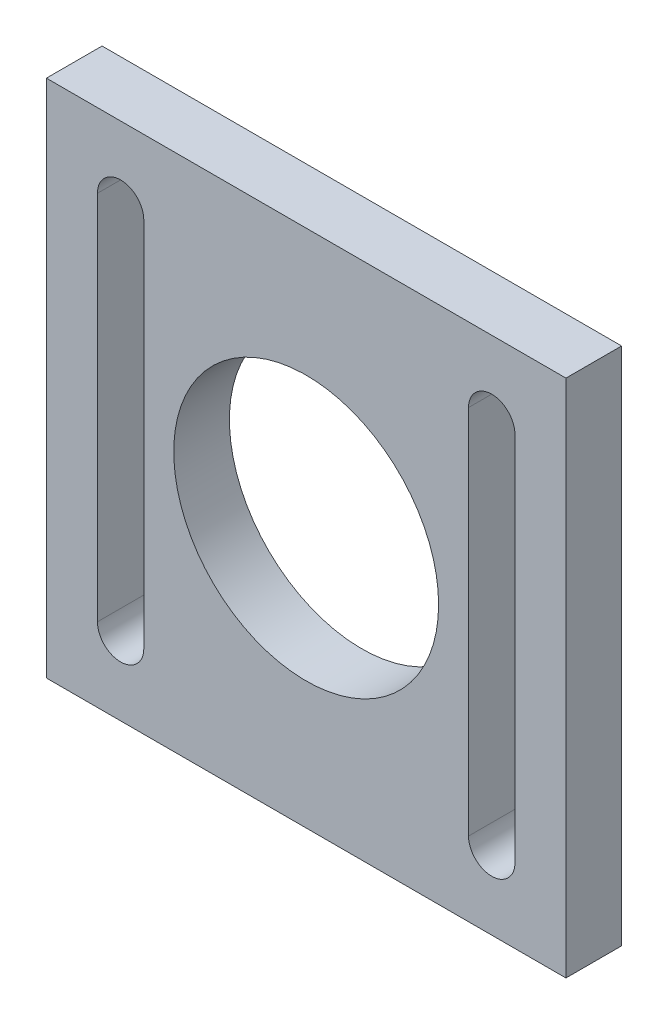
ISO-10303-21;
HEADER;
FILE_DESCRIPTION(('STEP AP214'),'2;1');
FILE_NAME('part.step','',(''),(''),'','','');
FILE_SCHEMA(('AUTOMOTIVE_DESIGN { 1 0 10303 214 1 1 1 1 }'));
ENDSEC;
DATA;
#1=APPLICATION_CONTEXT('core data for automotive mechanical design processes');
#2=APPLICATION_PROTOCOL_DEFINITION('international standard','automotive_design',2000,#1);
#3=PRODUCT_CONTEXT('',#1,'mechanical');
#4=PRODUCT('Part','Part','',(#3));
#5=PRODUCT_RELATED_PRODUCT_CATEGORY('part','',(#4));
#6=PRODUCT_DEFINITION_FORMATION('','',#4);
#7=PRODUCT_DEFINITION_CONTEXT('part definition',#1,'design');
#8=PRODUCT_DEFINITION('design','',#6,#7);
#9=PRODUCT_DEFINITION_SHAPE('','',#8);
#10=(LENGTH_UNIT() NAMED_UNIT(*) SI_UNIT(.MILLI.,.METRE.));
#11=(NAMED_UNIT(*) PLANE_ANGLE_UNIT() SI_UNIT($,.RADIAN.));
#12=(NAMED_UNIT(*) SI_UNIT($,.STERADIAN.) SOLID_ANGLE_UNIT());
#13=UNCERTAINTY_MEASURE_WITH_UNIT(LENGTH_MEASURE(1.E-05),#10,'distance_accuracy_value','');
#14=(GEOMETRIC_REPRESENTATION_CONTEXT(3) GLOBAL_UNCERTAINTY_ASSIGNED_CONTEXT((#13)) GLOBAL_UNIT_ASSIGNED_CONTEXT((#10,
#11,#12)) REPRESENTATION_CONTEXT('',''));
#15=CARTESIAN_POINT('',(0.,0.,0.));
#16=DIRECTION('',(0.,0.,1.));
#17=DIRECTION('',(1.,0.,0.));
#18=AXIS2_PLACEMENT_3D('',#15,#16,#17);
#19=CARTESIAN_POINT('',(0.,0.,6.));
#20=DIRECTION('',(-1.,0.,0.));
#21=DIRECTION('',(0.,0.,1.));
#22=AXIS2_PLACEMENT_3D('',#19,#20,#21);
#23=PLANE('',#22);
#24=DIRECTION('',(0.,1.,0.));
#25=VECTOR('',#24,1.);
#26=CARTESIAN_POINT('',(0.,0.,0.));
#27=LINE('',#26,#25);
#28=CARTESIAN_POINT('',(0.,0.,0.));
#29=VERTEX_POINT('',#28);
#30=CARTESIAN_POINT('',(0.,56.,0.));
#31=VERTEX_POINT('',#30);
#32=EDGE_CURVE('E199',#29,#31,#27,.T.);
#33=ORIENTED_EDGE('',*,*,#32,.F.);
#34=DIRECTION('',(0.,0.,-1.));
#35=VECTOR('',#34,1.);
#36=CARTESIAN_POINT('',(0.,0.,6.));
#37=LINE('',#36,#35);
#38=CARTESIAN_POINT('',(0.,0.,6.));
#39=VERTEX_POINT('',#38);
#40=EDGE_CURVE('E11',#39,#29,#37,.T.);
#41=ORIENTED_EDGE('',*,*,#40,.F.);
#42=DIRECTION('',(0.,1.,0.));
#43=VECTOR('',#42,1.);
#44=CARTESIAN_POINT('',(0.,0.,6.));
#45=LINE('',#44,#43);
#46=CARTESIAN_POINT('',(0.,56.,6.));
#47=VERTEX_POINT('',#46);
#48=EDGE_CURVE('E205',#39,#47,#45,.T.);
#49=ORIENTED_EDGE('',*,*,#48,.T.);
#50=DIRECTION('',(0.,0.,-1.));
#51=VECTOR('',#50,1.);
#52=CARTESIAN_POINT('',(0.,56.,6.));
#53=LINE('',#52,#51);
#54=EDGE_CURVE('E42',#47,#31,#53,.T.);
#55=ORIENTED_EDGE('',*,*,#54,.T.);
#56=EDGE_LOOP('',(#33,#41,#49,#55));
#57=FACE_BOUND('',#56,.T.);
#58=ADVANCED_FACE('F41',(#57),#23,.T.);
#59=CARTESIAN_POINT('',(0.,0.,6.));
#60=DIRECTION('',(0.,1.,0.));
#61=DIRECTION('',(0.,0.,1.));
#62=AXIS2_PLACEMENT_3D('',#59,#60,#61);
#63=PLANE('',#62);
#64=DIRECTION('',(1.,0.,0.));
#65=VECTOR('',#64,1.);
#66=CARTESIAN_POINT('',(0.,0.,0.));
#67=LINE('',#66,#65);
#68=CARTESIAN_POINT('',(56.,0.,0.));
#69=VERTEX_POINT('',#68);
#70=EDGE_CURVE('E206',#29,#69,#67,.T.);
#71=ORIENTED_EDGE('',*,*,#70,.T.);
#72=DIRECTION('',(0.,0.,-1.));
#73=VECTOR('',#72,1.);
#74=CARTESIAN_POINT('',(56.,0.,6.));
#75=LINE('',#74,#73);
#76=CARTESIAN_POINT('',(56.,0.,6.));
#77=VERTEX_POINT('',#76);
#78=EDGE_CURVE('E47',#77,#69,#75,.T.);
#79=ORIENTED_EDGE('',*,*,#78,.F.);
#80=DIRECTION('',(1.,0.,0.));
#81=VECTOR('',#80,1.);
#82=CARTESIAN_POINT('',(0.,0.,6.));
#83=LINE('',#82,#81);
#84=EDGE_CURVE('E211',#39,#77,#83,.T.);
#85=ORIENTED_EDGE('',*,*,#84,.F.);
#86=ORIENTED_EDGE('',*,*,#40,.T.);
#87=EDGE_LOOP('',(#71,#79,#85,#86));
#88=FACE_BOUND('',#87,.T.);
#89=ADVANCED_FACE('F236',(#88),#63,.F.);
#90=CARTESIAN_POINT('',(56.,0.,6.));
#91=DIRECTION('',(-1.,0.,0.));
#92=DIRECTION('',(0.,0.,1.));
#93=AXIS2_PLACEMENT_3D('',#90,#91,#92);
#94=PLANE('',#93);
#95=DIRECTION('',(0.,1.,0.));
#96=VECTOR('',#95,1.);
#97=CARTESIAN_POINT('',(56.,0.,0.));
#98=LINE('',#97,#96);
#99=CARTESIAN_POINT('',(56.,56.,0.));
#100=VERTEX_POINT('',#99);
#101=EDGE_CURVE('E217',#69,#100,#98,.T.);
#102=ORIENTED_EDGE('',*,*,#101,.T.);
#103=DIRECTION('',(0.,0.,-1.));
#104=VECTOR('',#103,1.);
#105=CARTESIAN_POINT('',(56.,56.,6.));
#106=LINE('',#105,#104);
#107=CARTESIAN_POINT('',(56.,56.,6.));
#108=VERTEX_POINT('',#107);
#109=EDGE_CURVE('E224',#108,#100,#106,.T.);
#110=ORIENTED_EDGE('',*,*,#109,.F.);
#111=DIRECTION('',(0.,1.,0.));
#112=VECTOR('',#111,1.);
#113=CARTESIAN_POINT('',(56.,0.,6.));
#114=LINE('',#113,#112);
#115=EDGE_CURVE('E207',#77,#108,#114,.T.);
#116=ORIENTED_EDGE('',*,*,#115,.F.);
#117=ORIENTED_EDGE('',*,*,#78,.T.);
#118=EDGE_LOOP('',(#102,#110,#116,#117));
#119=FACE_BOUND('',#118,.T.);
#120=ADVANCED_FACE('F244',(#119),#94,.F.);
#121=CARTESIAN_POINT('',(0.,56.,6.));
#122=DIRECTION('',(0.,1.,0.));
#123=DIRECTION('',(0.,0.,1.));
#124=AXIS2_PLACEMENT_3D('',#121,#122,#123);
#125=PLANE('',#124);
#126=DIRECTION('',(1.,0.,0.));
#127=VECTOR('',#126,1.);
#128=CARTESIAN_POINT('',(0.,56.,0.));
#129=LINE('',#128,#127);
#130=EDGE_CURVE('E214',#31,#100,#129,.T.);
#131=ORIENTED_EDGE('',*,*,#130,.F.);
#132=ORIENTED_EDGE('',*,*,#54,.F.);
#133=DIRECTION('',(1.,0.,0.));
#134=VECTOR('',#133,1.);
#135=CARTESIAN_POINT('',(0.,56.,6.));
#136=LINE('',#135,#134);
#137=EDGE_CURVE('E202',#47,#108,#136,.T.);
#138=ORIENTED_EDGE('',*,*,#137,.T.);
#139=ORIENTED_EDGE('',*,*,#109,.T.);
#140=EDGE_LOOP('',(#131,#132,#138,#139));
#141=FACE_BOUND('',#140,.T.);
#142=ADVANCED_FACE('F231',(#141),#125,.T.);
#143=CARTESIAN_POINT('',(0.,0.,6.));
#144=DIRECTION('',(0.,0.,-1.));
#145=DIRECTION('',(-1.,0.,0.));
#146=AXIS2_PLACEMENT_3D('',#143,#144,#145);
#147=PLANE('',#146);
#148=DIRECTION('',(0.,-1.,0.));
#149=VECTOR('',#148,1.);
#150=CARTESIAN_POINT('',(45.5,48.,6.));
#151=LINE('',#150,#149);
#152=CARTESIAN_POINT('',(45.5,48.,6.));
#153=VERTEX_POINT('',#152);
#154=CARTESIAN_POINT('',(45.5,8.,6.));
#155=VERTEX_POINT('',#154);
#156=EDGE_CURVE('E183',#153,#155,#151,.T.);
#157=ORIENTED_EDGE('',*,*,#156,.F.);
#158=CARTESIAN_POINT('',(48.,48.,6.));
#159=DIRECTION('',(0.,0.,1.));
#160=DIRECTION('',(1.,0.,0.));
#161=AXIS2_PLACEMENT_3D('',#158,#159,#160);
#162=CIRCLE('',#161,2.50000000000001);
#163=CARTESIAN_POINT('',(50.5,48.,6.));
#164=VERTEX_POINT('',#163);
#165=EDGE_CURVE('E60',#164,#153,#162,.T.);
#166=ORIENTED_EDGE('',*,*,#165,.F.);
#167=DIRECTION('',(0.,1.,0.));
#168=VECTOR('',#167,1.);
#169=CARTESIAN_POINT('',(50.5,48.,6.));
#170=LINE('',#169,#168);
#171=CARTESIAN_POINT('',(50.5,8.,6.));
#172=VERTEX_POINT('',#171);
#173=EDGE_CURVE('E178',#172,#164,#170,.T.);
#174=ORIENTED_EDGE('',*,*,#173,.F.);
#175=CARTESIAN_POINT('',(48.,8.,6.));
#176=DIRECTION('',(0.,0.,1.));
#177=DIRECTION('',(1.,0.,0.));
#178=AXIS2_PLACEMENT_3D('',#175,#176,#177);
#179=CIRCLE('',#178,2.50000000000001);
#180=EDGE_CURVE('E182',#155,#172,#179,.T.);
#181=ORIENTED_EDGE('',*,*,#180,.F.);
#182=EDGE_LOOP('',(#157,#166,#174,#181));
#183=FACE_BOUND('',#182,.T.);
#184=DIRECTION('',(0.,-1.,0.));
#185=VECTOR('',#184,1.);
#186=CARTESIAN_POINT('',(5.5,48.,6.));
#187=LINE('',#186,#185);
#188=CARTESIAN_POINT('',(5.5,48.,6.));
#189=VERTEX_POINT('',#188);
#190=CARTESIAN_POINT('',(5.5,8.,6.));
#191=VERTEX_POINT('',#190);
#192=EDGE_CURVE('E147',#189,#191,#187,.T.);
#193=ORIENTED_EDGE('',*,*,#192,.F.);
#194=CARTESIAN_POINT('',(8.,48.,6.));
#195=DIRECTION('',(0.,0.,1.));
#196=DIRECTION('',(1.,0.,0.));
#197=AXIS2_PLACEMENT_3D('',#194,#195,#196);
#198=CIRCLE('',#197,2.5);
#199=CARTESIAN_POINT('',(10.5,48.,6.));
#200=VERTEX_POINT('',#199);
#201=EDGE_CURVE('E63',#200,#189,#198,.T.);
#202=ORIENTED_EDGE('',*,*,#201,.F.);
#203=DIRECTION('',(0.,1.,0.));
#204=VECTOR('',#203,1.);
#205=CARTESIAN_POINT('',(10.5,48.,6.));
#206=LINE('',#205,#204);
#207=CARTESIAN_POINT('',(10.5,8.,6.));
#208=VERTEX_POINT('',#207);
#209=EDGE_CURVE('E137',#208,#200,#206,.T.);
#210=ORIENTED_EDGE('',*,*,#209,.F.);
#211=CARTESIAN_POINT('',(8.,8.,6.));
#212=DIRECTION('',(0.,0.,1.));
#213=DIRECTION('',(1.,0.,0.));
#214=AXIS2_PLACEMENT_3D('',#211,#212,#213);
#215=CIRCLE('',#214,2.5);
#216=EDGE_CURVE('E145',#191,#208,#215,.T.);
#217=ORIENTED_EDGE('',*,*,#216,.F.);
#218=EDGE_LOOP('',(#193,#202,#210,#217));
#219=FACE_BOUND('',#218,.T.);
#220=CARTESIAN_POINT('',(28.,28.,6.));
#221=DIRECTION('',(0.,0.,1.));
#222=DIRECTION('',(1.,0.,0.));
#223=AXIS2_PLACEMENT_3D('',#220,#221,#222);
#224=CIRCLE('',#223,14.275);
#225=CARTESIAN_POINT('',(42.275,28.,6.));
#226=VERTEX_POINT('',#225);
#227=EDGE_CURVE('E151',#226,#226,#224,.T.);
#228=ORIENTED_EDGE('',*,*,#227,.F.);
#229=EDGE_LOOP('',(#228));
#230=FACE_BOUND('',#229,.T.);
#231=ORIENTED_EDGE('',*,*,#48,.F.);
#232=ORIENTED_EDGE('',*,*,#84,.T.);
#233=ORIENTED_EDGE('',*,*,#115,.T.);
#234=ORIENTED_EDGE('',*,*,#137,.F.);
#235=EDGE_LOOP('',(#231,#232,#233,#234));
#236=FACE_BOUND('',#235,.T.);
#237=ADVANCED_FACE('F150',(#183,#219,#230,#236),#147,.F.);
#238=CARTESIAN_POINT('',(0.,0.,0.));
#239=DIRECTION('',(0.,0.,-1.));
#240=DIRECTION('',(-1.,0.,0.));
#241=AXIS2_PLACEMENT_3D('',#238,#239,#240);
#242=PLANE('',#241);
#243=CARTESIAN_POINT('',(48.,48.,0.));
#244=DIRECTION('',(0.,0.,1.));
#245=DIRECTION('',(1.,0.,0.));
#246=AXIS2_PLACEMENT_3D('',#243,#244,#245);
#247=CIRCLE('',#246,2.50000000000001);
#248=CARTESIAN_POINT('',(50.5,48.,0.));
#249=VERTEX_POINT('',#248);
#250=CARTESIAN_POINT('',(45.5,48.,0.));
#251=VERTEX_POINT('',#250);
#252=EDGE_CURVE('E185',#249,#251,#247,.T.);
#253=ORIENTED_EDGE('',*,*,#252,.T.);
#254=DIRECTION('',(0.,-1.,0.));
#255=VECTOR('',#254,1.);
#256=CARTESIAN_POINT('',(45.5,48.,0.));
#257=LINE('',#256,#255);
#258=CARTESIAN_POINT('',(45.5,8.,0.));
#259=VERTEX_POINT('',#258);
#260=EDGE_CURVE('E192',#251,#259,#257,.T.);
#261=ORIENTED_EDGE('',*,*,#260,.T.);
#262=CARTESIAN_POINT('',(48.,8.,0.));
#263=DIRECTION('',(0.,0.,1.));
#264=DIRECTION('',(1.,0.,0.));
#265=AXIS2_PLACEMENT_3D('',#262,#263,#264);
#266=CIRCLE('',#265,2.50000000000001);
#267=CARTESIAN_POINT('',(50.5,8.,0.));
#268=VERTEX_POINT('',#267);
#269=EDGE_CURVE('E191',#259,#268,#266,.T.);
#270=ORIENTED_EDGE('',*,*,#269,.T.);
#271=DIRECTION('',(0.,1.,0.));
#272=VECTOR('',#271,1.);
#273=CARTESIAN_POINT('',(50.5,48.,0.));
#274=LINE('',#273,#272);
#275=EDGE_CURVE('E172',#268,#249,#274,.T.);
#276=ORIENTED_EDGE('',*,*,#275,.T.);
#277=EDGE_LOOP('',(#253,#261,#270,#276));
#278=FACE_BOUND('',#277,.T.);
#279=CARTESIAN_POINT('',(8.,48.,0.));
#280=DIRECTION('',(0.,0.,1.));
#281=DIRECTION('',(1.,0.,0.));
#282=AXIS2_PLACEMENT_3D('',#279,#280,#281);
#283=CIRCLE('',#282,2.5);
#284=CARTESIAN_POINT('',(10.5,48.,0.));
#285=VERTEX_POINT('',#284);
#286=CARTESIAN_POINT('',(5.5,48.,0.));
#287=VERTEX_POINT('',#286);
#288=EDGE_CURVE('E134',#285,#287,#283,.T.);
#289=ORIENTED_EDGE('',*,*,#288,.T.);
#290=DIRECTION('',(0.,-1.,0.));
#291=VECTOR('',#290,1.);
#292=CARTESIAN_POINT('',(5.5,48.,0.));
#293=LINE('',#292,#291);
#294=CARTESIAN_POINT('',(5.5,8.,0.));
#295=VERTEX_POINT('',#294);
#296=EDGE_CURVE('E164',#287,#295,#293,.T.);
#297=ORIENTED_EDGE('',*,*,#296,.T.);
#298=CARTESIAN_POINT('',(8.,8.,0.));
#299=DIRECTION('',(0.,0.,1.));
#300=DIRECTION('',(1.,0.,0.));
#301=AXIS2_PLACEMENT_3D('',#298,#299,#300);
#302=CIRCLE('',#301,2.5);
#303=CARTESIAN_POINT('',(10.5,8.,0.));
#304=VERTEX_POINT('',#303);
#305=EDGE_CURVE('E161',#295,#304,#302,.T.);
#306=ORIENTED_EDGE('',*,*,#305,.T.);
#307=DIRECTION('',(0.,1.,0.));
#308=VECTOR('',#307,1.);
#309=CARTESIAN_POINT('',(10.5,48.,0.));
#310=LINE('',#309,#308);
#311=EDGE_CURVE('E157',#304,#285,#310,.T.);
#312=ORIENTED_EDGE('',*,*,#311,.T.);
#313=EDGE_LOOP('',(#289,#297,#306,#312));
#314=FACE_BOUND('',#313,.T.);
#315=CARTESIAN_POINT('',(28.,28.,0.));
#316=DIRECTION('',(0.,0.,1.));
#317=DIRECTION('',(1.,0.,0.));
#318=AXIS2_PLACEMENT_3D('',#315,#316,#317);
#319=CIRCLE('',#318,14.275);
#320=CARTESIAN_POINT('',(42.275,28.,0.));
#321=VERTEX_POINT('',#320);
#322=EDGE_CURVE('E152',#321,#321,#319,.T.);
#323=ORIENTED_EDGE('',*,*,#322,.T.);
#324=EDGE_LOOP('',(#323));
#325=FACE_BOUND('',#324,.T.);
#326=ORIENTED_EDGE('',*,*,#32,.T.);
#327=ORIENTED_EDGE('',*,*,#130,.T.);
#328=ORIENTED_EDGE('',*,*,#101,.F.);
#329=ORIENTED_EDGE('',*,*,#70,.F.);
#330=EDGE_LOOP('',(#326,#327,#328,#329));
#331=FACE_BOUND('',#330,.T.);
#332=ADVANCED_FACE('F234',(#278,#314,#325,#331),#242,.T.);
#333=CARTESIAN_POINT('',(28.,28.,0.));
#334=DIRECTION('',(0.,0.,1.));
#335=DIRECTION('',(1.,0.,0.));
#336=AXIS2_PLACEMENT_3D('',#333,#334,#335);
#337=CYLINDRICAL_SURFACE('',#336,14.275);
#338=ORIENTED_EDGE('',*,*,#322,.F.);
#339=EDGE_LOOP('',(#338));
#340=FACE_BOUND('',#339,.T.);
#341=ORIENTED_EDGE('',*,*,#227,.T.);
#342=EDGE_LOOP('',(#341));
#343=FACE_BOUND('',#342,.T.);
#344=ADVANCED_FACE('F253',(#340,#343),#337,.F.);
#345=CARTESIAN_POINT('',(8.,48.,0.));
#346=DIRECTION('',(0.,0.,1.));
#347=DIRECTION('',(1.,0.,0.));
#348=AXIS2_PLACEMENT_3D('',#345,#346,#347);
#349=CYLINDRICAL_SURFACE('',#348,2.5);
#350=ORIENTED_EDGE('',*,*,#201,.T.);
#351=DIRECTION('',(0.,0.,1.));
#352=VECTOR('',#351,1.);
#353=CARTESIAN_POINT('',(5.5,48.,0.));
#354=LINE('',#353,#352);
#355=EDGE_CURVE('E165',#287,#189,#354,.T.);
#356=ORIENTED_EDGE('',*,*,#355,.F.);
#357=ORIENTED_EDGE('',*,*,#288,.F.);
#358=DIRECTION('',(0.,0.,1.));
#359=VECTOR('',#358,1.);
#360=CARTESIAN_POINT('',(10.5,48.,0.));
#361=LINE('',#360,#359);
#362=EDGE_CURVE('E126',#285,#200,#361,.T.);
#363=ORIENTED_EDGE('',*,*,#362,.T.);
#364=EDGE_LOOP('',(#350,#356,#357,#363));
#365=FACE_BOUND('',#364,.T.);
#366=ADVANCED_FACE('F128',(#365),#349,.F.);
#367=CARTESIAN_POINT('',(10.5,48.,0.));
#368=DIRECTION('',(1.,0.,0.));
#369=DIRECTION('',(0.,1.,0.));
#370=AXIS2_PLACEMENT_3D('',#367,#368,#369);
#371=PLANE('',#370);
#372=ORIENTED_EDGE('',*,*,#209,.T.);
#373=ORIENTED_EDGE('',*,*,#362,.F.);
#374=ORIENTED_EDGE('',*,*,#311,.F.);
#375=DIRECTION('',(0.,0.,1.));
#376=VECTOR('',#375,1.);
#377=CARTESIAN_POINT('',(10.5,8.,0.));
#378=LINE('',#377,#376);
#379=EDGE_CURVE('E136',#304,#208,#378,.T.);
#380=ORIENTED_EDGE('',*,*,#379,.T.);
#381=EDGE_LOOP('',(#372,#373,#374,#380));
#382=FACE_BOUND('',#381,.T.);
#383=ADVANCED_FACE('F139',(#382),#371,.F.);
#384=CARTESIAN_POINT('',(8.,8.,0.));
#385=DIRECTION('',(0.,0.,1.));
#386=DIRECTION('',(1.,0.,0.));
#387=AXIS2_PLACEMENT_3D('',#384,#385,#386);
#388=CYLINDRICAL_SURFACE('',#387,2.5);
#389=ORIENTED_EDGE('',*,*,#216,.T.);
#390=ORIENTED_EDGE('',*,*,#379,.F.);
#391=ORIENTED_EDGE('',*,*,#305,.F.);
#392=DIRECTION('',(0.,0.,1.));
#393=VECTOR('',#392,1.);
#394=CARTESIAN_POINT('',(5.5,8.,0.));
#395=LINE('',#394,#393);
#396=EDGE_CURVE('E385',#295,#191,#395,.T.);
#397=ORIENTED_EDGE('',*,*,#396,.T.);
#398=EDGE_LOOP('',(#389,#390,#391,#397));
#399=FACE_BOUND('',#398,.T.);
#400=ADVANCED_FACE('F306',(#399),#388,.F.);
#401=CARTESIAN_POINT('',(5.5,48.,0.));
#402=DIRECTION('',(-1.,0.,0.));
#403=DIRECTION('',(0.,-1.,0.));
#404=AXIS2_PLACEMENT_3D('',#401,#402,#403);
#405=PLANE('',#404);
#406=ORIENTED_EDGE('',*,*,#192,.T.);
#407=ORIENTED_EDGE('',*,*,#396,.F.);
#408=ORIENTED_EDGE('',*,*,#296,.F.);
#409=ORIENTED_EDGE('',*,*,#355,.T.);
#410=EDGE_LOOP('',(#406,#407,#408,#409));
#411=FACE_BOUND('',#410,.T.);
#412=ADVANCED_FACE('F320',(#411),#405,.F.);
#413=CARTESIAN_POINT('',(48.,48.,0.));
#414=DIRECTION('',(0.,0.,1.));
#415=DIRECTION('',(1.,0.,0.));
#416=AXIS2_PLACEMENT_3D('',#413,#414,#415);
#417=CYLINDRICAL_SURFACE('',#416,2.50000000000001);
#418=ORIENTED_EDGE('',*,*,#165,.T.);
#419=DIRECTION('',(0.,0.,1.));
#420=VECTOR('',#419,1.);
#421=CARTESIAN_POINT('',(45.5,48.,0.));
#422=LINE('',#421,#420);
#423=EDGE_CURVE('E166',#251,#153,#422,.T.);
#424=ORIENTED_EDGE('',*,*,#423,.F.);
#425=ORIENTED_EDGE('',*,*,#252,.F.);
#426=DIRECTION('',(0.,0.,1.));
#427=VECTOR('',#426,1.);
#428=CARTESIAN_POINT('',(50.5,48.,0.));
#429=LINE('',#428,#427);
#430=EDGE_CURVE('E176',#249,#164,#429,.T.);
#431=ORIENTED_EDGE('',*,*,#430,.T.);
#432=EDGE_LOOP('',(#418,#424,#425,#431));
#433=FACE_BOUND('',#432,.T.);
#434=ADVANCED_FACE('F330',(#433),#417,.F.);
#435=CARTESIAN_POINT('',(50.5,48.,0.));
#436=DIRECTION('',(1.,0.,0.));
#437=DIRECTION('',(0.,0.,-1.));
#438=AXIS2_PLACEMENT_3D('',#435,#436,#437);
#439=PLANE('',#438);
#440=ORIENTED_EDGE('',*,*,#173,.T.);
#441=ORIENTED_EDGE('',*,*,#430,.F.);
#442=ORIENTED_EDGE('',*,*,#275,.F.);
#443=DIRECTION('',(0.,0.,1.));
#444=VECTOR('',#443,1.);
#445=CARTESIAN_POINT('',(50.5,8.,0.));
#446=LINE('',#445,#444);
#447=EDGE_CURVE('E171',#268,#172,#446,.T.);
#448=ORIENTED_EDGE('',*,*,#447,.T.);
#449=EDGE_LOOP('',(#440,#441,#442,#448));
#450=FACE_BOUND('',#449,.T.);
#451=ADVANCED_FACE('F339',(#450),#439,.F.);
#452=CARTESIAN_POINT('',(48.,8.,0.));
#453=DIRECTION('',(0.,0.,1.));
#454=DIRECTION('',(1.,0.,0.));
#455=AXIS2_PLACEMENT_3D('',#452,#453,#454);
#456=CYLINDRICAL_SURFACE('',#455,2.50000000000001);
#457=ORIENTED_EDGE('',*,*,#180,.T.);
#458=ORIENTED_EDGE('',*,*,#447,.F.);
#459=ORIENTED_EDGE('',*,*,#269,.F.);
#460=DIRECTION('',(0.,0.,1.));
#461=VECTOR('',#460,1.);
#462=CARTESIAN_POINT('',(45.5,8.,0.));
#463=LINE('',#462,#461);
#464=EDGE_CURVE('E174',#259,#155,#463,.T.);
#465=ORIENTED_EDGE('',*,*,#464,.T.);
#466=EDGE_LOOP('',(#457,#458,#459,#465));
#467=FACE_BOUND('',#466,.T.);
#468=ADVANCED_FACE('F347',(#467),#456,.F.);
#469=CARTESIAN_POINT('',(45.5,48.,0.));
#470=DIRECTION('',(-1.,0.,0.));
#471=DIRECTION('',(0.,0.,1.));
#472=AXIS2_PLACEMENT_3D('',#469,#470,#471);
#473=PLANE('',#472);
#474=ORIENTED_EDGE('',*,*,#156,.T.);
#475=ORIENTED_EDGE('',*,*,#464,.F.);
#476=ORIENTED_EDGE('',*,*,#260,.F.);
#477=ORIENTED_EDGE('',*,*,#423,.T.);
#478=EDGE_LOOP('',(#474,#475,#476,#477));
#479=FACE_BOUND('',#478,.T.);
#480=ADVANCED_FACE('F356',(#479),#473,.F.);
#481=CLOSED_SHELL('',(#58,#89,#120,#142,#237,#332,#344,#366,#383,#400,#412,#434,#451,#468,#480));
#482=MANIFOLD_SOLID_BREP('B2',#481);
#483=ADVANCED_BREP_SHAPE_REPRESENTATION('',(#18,#482),#14);
#484=SHAPE_DEFINITION_REPRESENTATION(#9,#483);
ENDSEC;
END-ISO-10303-21;
